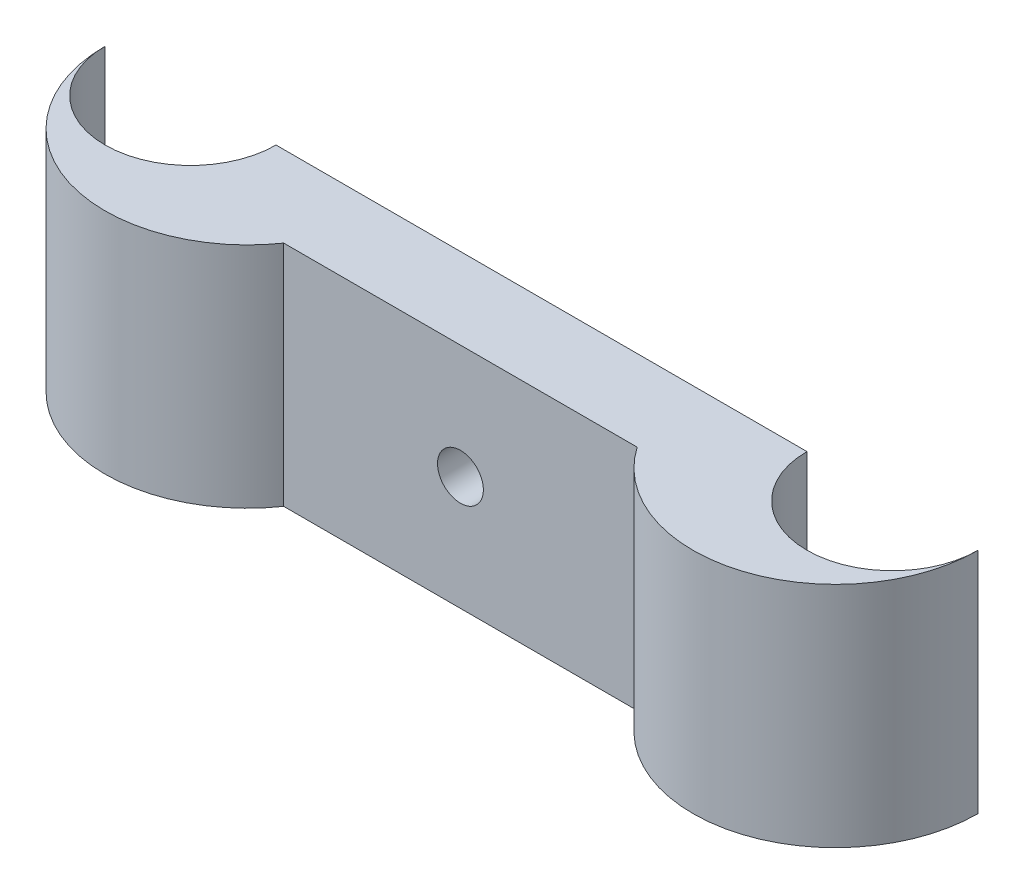
ISO-10303-21;
HEADER;
FILE_DESCRIPTION(('STEP AP214'),'2;1');
FILE_NAME('part.step','',(''),(''),'','','');
FILE_SCHEMA(('AUTOMOTIVE_DESIGN { 1 0 10303 214 1 1 1 1 }'));
ENDSEC;
DATA;
#1=APPLICATION_CONTEXT('core data for automotive mechanical design processes');
#2=APPLICATION_PROTOCOL_DEFINITION('international standard','automotive_design',2000,#1);
#3=PRODUCT_CONTEXT('',#1,'mechanical');
#4=PRODUCT('Part','Part','',(#3));
#5=PRODUCT_RELATED_PRODUCT_CATEGORY('part','',(#4));
#6=PRODUCT_DEFINITION_FORMATION('','',#4);
#7=PRODUCT_DEFINITION_CONTEXT('part definition',#1,'design');
#8=PRODUCT_DEFINITION('design','',#6,#7);
#9=PRODUCT_DEFINITION_SHAPE('','',#8);
#10=(LENGTH_UNIT() NAMED_UNIT(*) SI_UNIT(.MILLI.,.METRE.));
#11=(NAMED_UNIT(*) PLANE_ANGLE_UNIT() SI_UNIT($,.RADIAN.));
#12=(NAMED_UNIT(*) SI_UNIT($,.STERADIAN.) SOLID_ANGLE_UNIT());
#13=UNCERTAINTY_MEASURE_WITH_UNIT(LENGTH_MEASURE(1.E-05),#10,'distance_accuracy_value','');
#14=(GEOMETRIC_REPRESENTATION_CONTEXT(3) GLOBAL_UNCERTAINTY_ASSIGNED_CONTEXT((#13)) GLOBAL_UNIT_ASSIGNED_CONTEXT((#10,
#11,#12)) REPRESENTATION_CONTEXT('',''));
#15=CARTESIAN_POINT('',(0.,0.,0.));
#16=DIRECTION('',(0.,0.,1.));
#17=DIRECTION('',(1.,0.,0.));
#18=AXIS2_PLACEMENT_3D('',#15,#16,#17);
#19=CARTESIAN_POINT('',(25.78,20.,0.));
#20=DIRECTION('',(0.,-1.,0.));
#21=DIRECTION('',(0.,0.,-1.));
#22=AXIS2_PLACEMENT_3D('',#19,#20,#21);
#23=CYLINDRICAL_SURFACE('',#22,12.5);
#24=CARTESIAN_POINT('',(25.78,0.,0.));
#25=DIRECTION('',(0.,1.,0.));
#26=DIRECTION('',(0.,0.,1.));
#27=AXIS2_PLACEMENT_3D('',#24,#25,#26);
#28=CIRCLE('',#27,12.5);
#29=CARTESIAN_POINT('',(15.4990516001684,0.,7.11));
#30=VERTEX_POINT('',#29);
#31=CARTESIAN_POINT('',(38.28,0.,0.));
#32=VERTEX_POINT('',#31);
#33=EDGE_CURVE('E128',#30,#32,#28,.T.);
#34=ORIENTED_EDGE('',*,*,#33,.T.);
#35=DIRECTION('',(0.,-1.,0.));
#36=VECTOR('',#35,1.);
#37=CARTESIAN_POINT('',(38.28,20.,0.));
#38=LINE('',#37,#36);
#39=CARTESIAN_POINT('',(38.28,20.,0.));
#40=VERTEX_POINT('',#39);
#41=EDGE_CURVE('E11',#40,#32,#38,.T.);
#42=ORIENTED_EDGE('',*,*,#41,.F.);
#43=CARTESIAN_POINT('',(25.78,20.,0.));
#44=DIRECTION('',(0.,1.,0.));
#45=DIRECTION('',(0.,0.,1.));
#46=AXIS2_PLACEMENT_3D('',#43,#44,#45);
#47=CIRCLE('',#46,12.5);
#48=CARTESIAN_POINT('',(15.4990516001684,20.,7.11));
#49=VERTEX_POINT('',#48);
#50=EDGE_CURVE('E144',#49,#40,#47,.T.);
#51=ORIENTED_EDGE('',*,*,#50,.F.);
#52=DIRECTION('',(0.,-1.,0.));
#53=VECTOR('',#52,1.);
#54=CARTESIAN_POINT('',(15.4990516001684,20.,7.11));
#55=LINE('',#54,#53);
#56=EDGE_CURVE('E124',#49,#30,#55,.T.);
#57=ORIENTED_EDGE('',*,*,#56,.T.);
#58=EDGE_LOOP('',(#34,#42,#51,#57));
#59=FACE_BOUND('',#58,.T.);
#60=ADVANCED_FACE('F37',(#59),#23,.T.);
#61=CARTESIAN_POINT('',(30.78,20.,0.));
#62=DIRECTION('',(0.,-1.,0.));
#63=DIRECTION('',(0.,0.,-1.));
#64=AXIS2_PLACEMENT_3D('',#61,#62,#63);
#65=CYLINDRICAL_SURFACE('',#64,7.5);
#66=CARTESIAN_POINT('',(30.78,0.,0.));
#67=DIRECTION('',(0.,-1.,0.));
#68=DIRECTION('',(0.,0.,1.));
#69=AXIS2_PLACEMENT_3D('',#66,#67,#68);
#70=CIRCLE('',#69,7.5);
#71=CARTESIAN_POINT('',(23.28,0.,0.));
#72=VERTEX_POINT('',#71);
#73=EDGE_CURVE('E132',#32,#72,#70,.T.);
#74=ORIENTED_EDGE('',*,*,#73,.T.);
#75=DIRECTION('',(0.,-1.,0.));
#76=VECTOR('',#75,1.);
#77=CARTESIAN_POINT('',(23.28,20.,0.));
#78=LINE('',#77,#76);
#79=CARTESIAN_POINT('',(23.28,20.,0.));
#80=VERTEX_POINT('',#79);
#81=EDGE_CURVE('E47',#80,#72,#78,.T.);
#82=ORIENTED_EDGE('',*,*,#81,.F.);
#83=CARTESIAN_POINT('',(30.78,20.,0.));
#84=DIRECTION('',(0.,-1.,0.));
#85=DIRECTION('',(0.,0.,1.));
#86=AXIS2_PLACEMENT_3D('',#83,#84,#85);
#87=CIRCLE('',#86,7.5);
#88=EDGE_CURVE('E92',#40,#80,#87,.T.);
#89=ORIENTED_EDGE('',*,*,#88,.F.);
#90=ORIENTED_EDGE('',*,*,#41,.T.);
#91=EDGE_LOOP('',(#74,#82,#89,#90));
#92=FACE_BOUND('',#91,.T.);
#93=ADVANCED_FACE('F176',(#92),#65,.F.);
#94=CARTESIAN_POINT('',(-23.28,20.,0.));
#95=DIRECTION('',(0.,0.,1.));
#96=DIRECTION('',(1.,0.,0.));
#97=AXIS2_PLACEMENT_3D('',#94,#95,#96);
#98=PLANE('',#97);
#99=CARTESIAN_POINT('',(0.,10.,0.));
#100=DIRECTION('',(0.,0.,-1.));
#101=DIRECTION('',(-1.,0.,0.));
#102=AXIS2_PLACEMENT_3D('',#99,#100,#101);
#103=CIRCLE('',#102,2.01);
#104=CARTESIAN_POINT('',(-2.01,10.,0.));
#105=VERTEX_POINT('',#104);
#106=EDGE_CURVE('E261',#105,#105,#103,.T.);
#107=ORIENTED_EDGE('',*,*,#106,.F.);
#108=EDGE_LOOP('',(#107));
#109=FACE_BOUND('',#108,.T.);
#110=DIRECTION('',(-1.,0.,0.));
#111=VECTOR('',#110,1.);
#112=CARTESIAN_POINT('',(-23.28,0.,0.));
#113=LINE('',#112,#111);
#114=CARTESIAN_POINT('',(-23.28,0.,0.));
#115=VERTEX_POINT('',#114);
#116=EDGE_CURVE('E135',#72,#115,#113,.T.);
#117=ORIENTED_EDGE('',*,*,#116,.T.);
#118=DIRECTION('',(0.,-1.,0.));
#119=VECTOR('',#118,1.);
#120=CARTESIAN_POINT('',(-23.28,20.,0.));
#121=LINE('',#120,#119);
#122=CARTESIAN_POINT('',(-23.28,20.,0.));
#123=VERTEX_POINT('',#122);
#124=EDGE_CURVE('E116',#123,#115,#121,.T.);
#125=ORIENTED_EDGE('',*,*,#124,.F.);
#126=DIRECTION('',(-1.,0.,0.));
#127=VECTOR('',#126,1.);
#128=CARTESIAN_POINT('',(-23.28,20.,0.));
#129=LINE('',#128,#127);
#130=EDGE_CURVE('E105',#80,#123,#129,.T.);
#131=ORIENTED_EDGE('',*,*,#130,.F.);
#132=ORIENTED_EDGE('',*,*,#81,.T.);
#133=EDGE_LOOP('',(#117,#125,#131,#132));
#134=FACE_BOUND('',#133,.T.);
#135=ADVANCED_FACE('F156',(#109,#134),#98,.F.);
#136=CARTESIAN_POINT('',(-30.78,20.,0.));
#137=DIRECTION('',(0.,-1.,0.));
#138=DIRECTION('',(0.,0.,-1.));
#139=AXIS2_PLACEMENT_3D('',#136,#137,#138);
#140=CYLINDRICAL_SURFACE('',#139,7.5);
#141=CARTESIAN_POINT('',(-30.78,0.,0.));
#142=DIRECTION('',(0.,-1.,0.));
#143=DIRECTION('',(0.,0.,1.));
#144=AXIS2_PLACEMENT_3D('',#141,#142,#143);
#145=CIRCLE('',#144,7.5);
#146=CARTESIAN_POINT('',(-38.28,0.,0.));
#147=VERTEX_POINT('',#146);
#148=EDGE_CURVE('E114',#115,#147,#145,.T.);
#149=ORIENTED_EDGE('',*,*,#148,.T.);
#150=DIRECTION('',(0.,-1.,0.));
#151=VECTOR('',#150,1.);
#152=CARTESIAN_POINT('',(-38.28,20.,0.));
#153=LINE('',#152,#151);
#154=CARTESIAN_POINT('',(-38.28,20.,0.));
#155=VERTEX_POINT('',#154);
#156=EDGE_CURVE('E111',#155,#147,#153,.T.);
#157=ORIENTED_EDGE('',*,*,#156,.F.);
#158=CARTESIAN_POINT('',(-30.78,20.,0.));
#159=DIRECTION('',(0.,-1.,0.));
#160=DIRECTION('',(0.,0.,1.));
#161=AXIS2_PLACEMENT_3D('',#158,#159,#160);
#162=CIRCLE('',#161,7.5);
#163=EDGE_CURVE('E99',#123,#155,#162,.T.);
#164=ORIENTED_EDGE('',*,*,#163,.F.);
#165=ORIENTED_EDGE('',*,*,#124,.T.);
#166=EDGE_LOOP('',(#149,#157,#164,#165));
#167=FACE_BOUND('',#166,.T.);
#168=ADVANCED_FACE('F112',(#167),#140,.F.);
#169=CARTESIAN_POINT('',(-25.78,20.,0.));
#170=DIRECTION('',(0.,-1.,0.));
#171=DIRECTION('',(0.,0.,-1.));
#172=AXIS2_PLACEMENT_3D('',#169,#170,#171);
#173=CYLINDRICAL_SURFACE('',#172,12.5);
#174=CARTESIAN_POINT('',(-25.78,0.,0.));
#175=DIRECTION('',(0.,1.,0.));
#176=DIRECTION('',(0.,0.,1.));
#177=AXIS2_PLACEMENT_3D('',#174,#175,#176);
#178=CIRCLE('',#177,12.5);
#179=CARTESIAN_POINT('',(-15.4990516001684,0.,7.11));
#180=VERTEX_POINT('',#179);
#181=EDGE_CURVE('E78',#147,#180,#178,.T.);
#182=ORIENTED_EDGE('',*,*,#181,.T.);
#183=DIRECTION('',(0.,-1.,0.));
#184=VECTOR('',#183,1.);
#185=CARTESIAN_POINT('',(-15.4990516001684,20.,7.11));
#186=LINE('',#185,#184);
#187=CARTESIAN_POINT('',(-15.4990516001684,20.,7.11));
#188=VERTEX_POINT('',#187);
#189=EDGE_CURVE('E117',#188,#180,#186,.T.);
#190=ORIENTED_EDGE('',*,*,#189,.F.);
#191=CARTESIAN_POINT('',(-25.78,20.,0.));
#192=DIRECTION('',(0.,1.,0.));
#193=DIRECTION('',(0.,0.,1.));
#194=AXIS2_PLACEMENT_3D('',#191,#192,#193);
#195=CIRCLE('',#194,12.5);
#196=EDGE_CURVE('E103',#155,#188,#195,.T.);
#197=ORIENTED_EDGE('',*,*,#196,.F.);
#198=ORIENTED_EDGE('',*,*,#156,.T.);
#199=EDGE_LOOP('',(#182,#190,#197,#198));
#200=FACE_BOUND('',#199,.T.);
#201=ADVANCED_FACE('F119',(#200),#173,.T.);
#202=CARTESIAN_POINT('',(-15.4990516001684,20.,7.11));
#203=DIRECTION('',(0.,0.,-1.));
#204=DIRECTION('',(-1.,0.,0.));
#205=AXIS2_PLACEMENT_3D('',#202,#203,#204);
#206=PLANE('',#205);
#207=CARTESIAN_POINT('',(0.,10.,7.11));
#208=DIRECTION('',(0.,0.,-1.));
#209=DIRECTION('',(-1.,0.,0.));
#210=AXIS2_PLACEMENT_3D('',#207,#208,#209);
#211=CIRCLE('',#210,2.01);
#212=CARTESIAN_POINT('',(-2.01,10.,7.11));
#213=VERTEX_POINT('',#212);
#214=EDGE_CURVE('E40',#213,#213,#211,.T.);
#215=ORIENTED_EDGE('',*,*,#214,.T.);
#216=EDGE_LOOP('',(#215));
#217=FACE_BOUND('',#216,.T.);
#218=DIRECTION('',(1.,0.,0.));
#219=VECTOR('',#218,1.);
#220=CARTESIAN_POINT('',(-15.4990516001684,0.,7.11));
#221=LINE('',#220,#219);
#222=EDGE_CURVE('E84',#180,#30,#221,.T.);
#223=ORIENTED_EDGE('',*,*,#222,.T.);
#224=ORIENTED_EDGE('',*,*,#56,.F.);
#225=DIRECTION('',(1.,0.,0.));
#226=VECTOR('',#225,1.);
#227=CARTESIAN_POINT('',(-15.4990516001684,20.,7.11));
#228=LINE('',#227,#226);
#229=EDGE_CURVE('E55',#188,#49,#228,.T.);
#230=ORIENTED_EDGE('',*,*,#229,.F.);
#231=ORIENTED_EDGE('',*,*,#189,.T.);
#232=EDGE_LOOP('',(#223,#224,#230,#231));
#233=FACE_BOUND('',#232,.T.);
#234=ADVANCED_FACE('F163',(#217,#233),#206,.F.);
#235=CARTESIAN_POINT('',(25.78,20.,0.));
#236=DIRECTION('',(0.,1.,0.));
#237=DIRECTION('',(0.,0.,1.));
#238=AXIS2_PLACEMENT_3D('',#235,#236,#237);
#239=PLANE('',#238);
#240=ORIENTED_EDGE('',*,*,#50,.T.);
#241=ORIENTED_EDGE('',*,*,#88,.T.);
#242=ORIENTED_EDGE('',*,*,#130,.T.);
#243=ORIENTED_EDGE('',*,*,#163,.T.);
#244=ORIENTED_EDGE('',*,*,#196,.T.);
#245=ORIENTED_EDGE('',*,*,#229,.T.);
#246=EDGE_LOOP('',(#240,#241,#242,#243,#244,#245));
#247=FACE_BOUND('',#246,.T.);
#248=ADVANCED_FACE('F101',(#247),#239,.T.);
#249=CARTESIAN_POINT('',(25.78,0.,0.));
#250=DIRECTION('',(0.,1.,0.));
#251=DIRECTION('',(0.,0.,1.));
#252=AXIS2_PLACEMENT_3D('',#249,#250,#251);
#253=PLANE('',#252);
#254=ORIENTED_EDGE('',*,*,#33,.F.);
#255=ORIENTED_EDGE('',*,*,#222,.F.);
#256=ORIENTED_EDGE('',*,*,#181,.F.);
#257=ORIENTED_EDGE('',*,*,#148,.F.);
#258=ORIENTED_EDGE('',*,*,#116,.F.);
#259=ORIENTED_EDGE('',*,*,#73,.F.);
#260=EDGE_LOOP('',(#254,#255,#256,#257,#258,#259));
#261=FACE_BOUND('',#260,.T.);
#262=ADVANCED_FACE('F159',(#261),#253,.F.);
#263=CARTESIAN_POINT('',(0.,10.,20.));
#264=DIRECTION('',(0.,0.,-1.));
#265=DIRECTION('',(-1.,0.,0.));
#266=AXIS2_PLACEMENT_3D('',#263,#264,#265);
#267=CYLINDRICAL_SURFACE('',#266,2.01);
#268=ORIENTED_EDGE('',*,*,#106,.T.);
#269=EDGE_LOOP('',(#268));
#270=FACE_BOUND('',#269,.T.);
#271=ORIENTED_EDGE('',*,*,#214,.F.);
#272=EDGE_LOOP('',(#271));
#273=FACE_BOUND('',#272,.T.);
#274=ADVANCED_FACE('F216',(#270,#273),#267,.F.);
#275=CLOSED_SHELL('',(#60,#93,#135,#168,#201,#234,#248,#262,#274));
#276=MANIFOLD_SOLID_BREP('B2',#275);
#277=ADVANCED_BREP_SHAPE_REPRESENTATION('',(#18,#276),#14);
#278=SHAPE_DEFINITION_REPRESENTATION(#9,#277);
ENDSEC;
END-ISO-10303-21;
